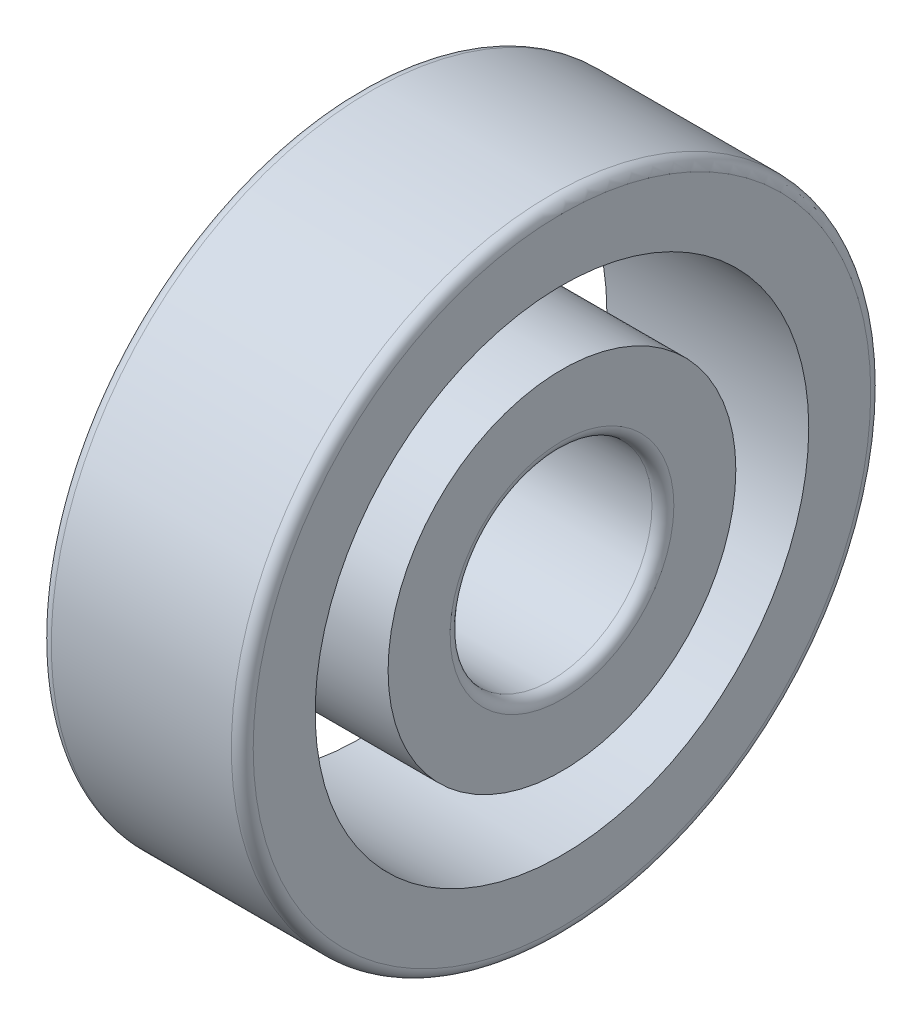
ISO-10303-21;
HEADER;
FILE_DESCRIPTION(('STEP AP214'),'2;1');
FILE_NAME('part.step','',(''),(''),'','','');
FILE_SCHEMA(('AUTOMOTIVE_DESIGN { 1 0 10303 214 1 1 1 1 }'));
ENDSEC;
DATA;
#1=APPLICATION_CONTEXT('core data for automotive mechanical design processes');
#2=APPLICATION_PROTOCOL_DEFINITION('international standard','automotive_design',2000,#1);
#3=PRODUCT_CONTEXT('',#1,'mechanical');
#4=PRODUCT('Part','Part','',(#3));
#5=PRODUCT_RELATED_PRODUCT_CATEGORY('part','',(#4));
#6=PRODUCT_DEFINITION_FORMATION('','',#4);
#7=PRODUCT_DEFINITION_CONTEXT('part definition',#1,'design');
#8=PRODUCT_DEFINITION('design','',#6,#7);
#9=PRODUCT_DEFINITION_SHAPE('','',#8);
#10=(LENGTH_UNIT() NAMED_UNIT(*) SI_UNIT(.MILLI.,.METRE.));
#11=(NAMED_UNIT(*) PLANE_ANGLE_UNIT() SI_UNIT($,.RADIAN.));
#12=(NAMED_UNIT(*) SI_UNIT($,.STERADIAN.) SOLID_ANGLE_UNIT());
#13=UNCERTAINTY_MEASURE_WITH_UNIT(LENGTH_MEASURE(1.E-05),#10,'distance_accuracy_value','');
#14=(GEOMETRIC_REPRESENTATION_CONTEXT(3) GLOBAL_UNCERTAINTY_ASSIGNED_CONTEXT((#13)) GLOBAL_UNIT_ASSIGNED_CONTEXT((#10,
#11,#12)) REPRESENTATION_CONTEXT('',''));
#15=CARTESIAN_POINT('',(0.,0.,0.));
#16=DIRECTION('',(0.,0.,1.));
#17=DIRECTION('',(1.,0.,0.));
#18=AXIS2_PLACEMENT_3D('',#15,#16,#17);
#19=CARTESIAN_POINT('',(0.325000000000005,0.,0.));
#20=DIRECTION('',(1.,0.,0.));
#21=DIRECTION('',(0.,0.,-1.));
#22=AXIS2_PLACEMENT_3D('',#19,#20,#21);
#23=CYLINDRICAL_SURFACE('',#22,3.);
#24=CARTESIAN_POINT('',(5.675,0.,0.));
#25=DIRECTION('',(1.,0.,0.));
#26=DIRECTION('',(0.,0.,-1.));
#27=AXIS2_PLACEMENT_3D('',#24,#25,#26);
#28=CIRCLE('',#27,3.);
#29=CARTESIAN_POINT('',(5.675,0.,-3.));
#30=VERTEX_POINT('',#29);
#31=EDGE_CURVE('P0_E70',#30,#30,#28,.F.);
#32=ORIENTED_EDGE('',*,*,#31,.F.);
#33=EDGE_LOOP('',(#32));
#34=FACE_BOUND('',#33,.T.);
#35=CARTESIAN_POINT('',(0.325000000000005,0.,0.));
#36=DIRECTION('',(1.,0.,0.));
#37=DIRECTION('',(0.,0.,-1.));
#38=AXIS2_PLACEMENT_3D('',#35,#36,#37);
#39=CIRCLE('',#38,3.);
#40=CARTESIAN_POINT('',(0.325000000000005,0.,-3.));
#41=VERTEX_POINT('',#40);
#42=EDGE_CURVE('P0_E68',#41,#41,#39,.T.);
#43=ORIENTED_EDGE('',*,*,#42,.F.);
#44=EDGE_LOOP('',(#43));
#45=FACE_BOUND('',#44,.T.);
#46=ADVANCED_FACE('P0_F31',(#34,#45),#23,.F.);
#47=CARTESIAN_POINT('',(0.325000000000005,0.,0.));
#48=DIRECTION('',(1.,0.,0.));
#49=DIRECTION('',(0.,0.,-1.));
#50=AXIS2_PLACEMENT_3D('',#47,#48,#49);
#51=TOROIDAL_SURFACE('',#50,3.325,0.325);
#52=CARTESIAN_POINT('',(0.,0.,0.));
#53=DIRECTION('',(-1.,0.,0.));
#54=DIRECTION('',(0.,1.,0.));
#55=AXIS2_PLACEMENT_3D('',#52,#53,#54);
#56=CIRCLE('',#55,3.325);
#57=CARTESIAN_POINT('',(0.,3.325,0.));
#58=VERTEX_POINT('',#57);
#59=EDGE_CURVE('P0_E75',#58,#58,#56,.F.);
#60=ORIENTED_EDGE('',*,*,#59,.F.);
#61=EDGE_LOOP('',(#60));
#62=FACE_BOUND('',#61,.T.);
#63=ORIENTED_EDGE('',*,*,#42,.T.);
#64=EDGE_LOOP('',(#63));
#65=FACE_BOUND('',#64,.T.);
#66=ADVANCED_FACE('P0_F50',(#62,#65),#51,.T.);
#67=CARTESIAN_POINT('',(5.675,0.,0.));
#68=DIRECTION('',(1.,0.,0.));
#69=DIRECTION('',(0.,0.,-1.));
#70=AXIS2_PLACEMENT_3D('',#67,#68,#69);
#71=TOROIDAL_SURFACE('',#70,3.325,0.325);
#72=ORIENTED_EDGE('',*,*,#31,.T.);
#73=EDGE_LOOP('',(#72));
#74=FACE_BOUND('',#73,.T.);
#75=CARTESIAN_POINT('',(6.,0.,0.));
#76=DIRECTION('',(1.,0.,0.));
#77=DIRECTION('',(0.,1.,0.));
#78=AXIS2_PLACEMENT_3D('',#75,#76,#77);
#79=CIRCLE('',#78,3.325);
#80=CARTESIAN_POINT('',(6.,3.325,0.));
#81=VERTEX_POINT('',#80);
#82=EDGE_CURVE('P0_E42',#81,#81,#79,.F.);
#83=ORIENTED_EDGE('',*,*,#82,.F.);
#84=EDGE_LOOP('',(#83));
#85=FACE_BOUND('',#84,.T.);
#86=ADVANCED_FACE('P0_F61',(#74,#85),#71,.T.);
#87=CARTESIAN_POINT('',(0.,4.08333333333333,0.));
#88=DIRECTION('',(-1.,0.,0.));
#89=DIRECTION('',(0.,0.,1.));
#90=AXIS2_PLACEMENT_3D('',#87,#88,#89);
#91=PLANE('',#90);
#92=ORIENTED_EDGE('',*,*,#59,.T.);
#93=EDGE_LOOP('',(#92));
#94=FACE_BOUND('',#93,.T.);
#95=CARTESIAN_POINT('',(0.,0.,0.));
#96=DIRECTION('',(1.,0.,0.));
#97=DIRECTION('',(0.,0.,-1.));
#98=AXIS2_PLACEMENT_3D('',#95,#96,#97);
#99=CIRCLE('',#98,5.16666666666667);
#100=CARTESIAN_POINT('',(0.,0.,-5.16666666666667));
#101=VERTEX_POINT('',#100);
#102=EDGE_CURVE('P0_E35',#101,#101,#99,.T.);
#103=ORIENTED_EDGE('',*,*,#102,.F.);
#104=EDGE_LOOP('',(#103));
#105=FACE_BOUND('',#104,.T.);
#106=ADVANCED_FACE('P0_F84',(#94,#105),#91,.T.);
#107=CARTESIAN_POINT('',(6.,4.08333333333333,0.));
#108=DIRECTION('',(1.,0.,0.));
#109=DIRECTION('',(0.,0.,-1.));
#110=AXIS2_PLACEMENT_3D('',#107,#108,#109);
#111=PLANE('',#110);
#112=ORIENTED_EDGE('',*,*,#82,.T.);
#113=EDGE_LOOP('',(#112));
#114=FACE_BOUND('',#113,.T.);
#115=CARTESIAN_POINT('',(6.,0.,0.));
#116=DIRECTION('',(1.,0.,0.));
#117=DIRECTION('',(0.,0.,-1.));
#118=AXIS2_PLACEMENT_3D('',#115,#116,#117);
#119=CIRCLE('',#118,5.16666666666667);
#120=CARTESIAN_POINT('',(6.,0.,-5.16666666666667));
#121=VERTEX_POINT('',#120);
#122=EDGE_CURVE('P0_E10',#121,#121,#119,.F.);
#123=ORIENTED_EDGE('',*,*,#122,.F.);
#124=EDGE_LOOP('',(#123));
#125=FACE_BOUND('',#124,.T.);
#126=ADVANCED_FACE('P0_F92',(#114,#125),#111,.T.);
#127=CARTESIAN_POINT('',(3.00000000000001,0.,0.));
#128=DIRECTION('',(1.,0.,0.));
#129=DIRECTION('',(0.,0.,-1.));
#130=AXIS2_PLACEMENT_3D('',#127,#128,#129);
#131=CYLINDRICAL_SURFACE('',#130,5.16666666666667);
#132=ORIENTED_EDGE('',*,*,#102,.T.);
#133=EDGE_LOOP('',(#132));
#134=FACE_BOUND('',#133,.T.);
#135=ORIENTED_EDGE('',*,*,#122,.T.);
#136=EDGE_LOOP('',(#135));
#137=FACE_BOUND('',#136,.T.);
#138=ADVANCED_FACE('P0_F33',(#134,#137),#131,.T.);
#139=CLOSED_SHELL('',(#46,#66,#86,#106,#126,#138));
#140=MANIFOLD_SOLID_BREP('P0_B2',#139);
#141=CARTESIAN_POINT('',(0.,0.,0.));
#142=DIRECTION('',(1.,0.,0.));
#143=DIRECTION('',(0.,0.,-1.));
#144=AXIS2_PLACEMENT_3D('',#141,#142,#143);
#145=CYLINDRICAL_SURFACE('',#144,7.33333333333333);
#146=CARTESIAN_POINT('',(0.,0.,0.));
#147=DIRECTION('',(1.,0.,0.));
#148=DIRECTION('',(0.,0.,-1.));
#149=AXIS2_PLACEMENT_3D('',#146,#147,#148);
#150=CIRCLE('',#149,7.33333333333333);
#151=CARTESIAN_POINT('',(0.,0.,-7.33333333333333));
#152=VERTEX_POINT('',#151);
#153=EDGE_CURVE('P1_E18',#152,#152,#150,.T.);
#154=ORIENTED_EDGE('',*,*,#153,.F.);
#155=EDGE_LOOP('',(#154));
#156=FACE_BOUND('',#155,.T.);
#157=CARTESIAN_POINT('',(6.,0.,0.));
#158=DIRECTION('',(1.,0.,0.));
#159=DIRECTION('',(0.,0.,-1.));
#160=AXIS2_PLACEMENT_3D('',#157,#158,#159);
#161=CIRCLE('',#160,7.33333333333333);
#162=CARTESIAN_POINT('',(6.,0.,-7.33333333333333));
#163=VERTEX_POINT('',#162);
#164=EDGE_CURVE('P1_E102',#163,#163,#161,.F.);
#165=ORIENTED_EDGE('',*,*,#164,.F.);
#166=EDGE_LOOP('',(#165));
#167=FACE_BOUND('',#166,.T.);
#168=ADVANCED_FACE('P1_F14',(#156,#167),#145,.F.);
#169=CARTESIAN_POINT('',(0.,8.41666666666667,0.));
#170=DIRECTION('',(-1.,0.,0.));
#171=DIRECTION('',(0.,0.,1.));
#172=AXIS2_PLACEMENT_3D('',#169,#170,#171);
#173=PLANE('',#172);
#174=CARTESIAN_POINT('',(0.,0.,0.));
#175=DIRECTION('',(1.,0.,0.));
#176=DIRECTION('',(0.,1.,0.));
#177=AXIS2_PLACEMENT_3D('',#174,#175,#176);
#178=CIRCLE('',#177,9.175);
#179=CARTESIAN_POINT('',(0.,9.175,0.));
#180=VERTEX_POINT('',#179);
#181=EDGE_CURVE('P1_E101',#180,#180,#178,.T.);
#182=ORIENTED_EDGE('',*,*,#181,.F.);
#183=EDGE_LOOP('',(#182));
#184=FACE_BOUND('',#183,.T.);
#185=ORIENTED_EDGE('',*,*,#153,.T.);
#186=EDGE_LOOP('',(#185));
#187=FACE_BOUND('',#186,.T.);
#188=ADVANCED_FACE('P1_F75',(#184,#187),#173,.T.);
#189=CARTESIAN_POINT('',(6.,8.41666666666667,0.));
#190=DIRECTION('',(1.,0.,0.));
#191=DIRECTION('',(0.,0.,-1.));
#192=AXIS2_PLACEMENT_3D('',#189,#190,#191);
#193=PLANE('',#192);
#194=CARTESIAN_POINT('',(6.,0.,0.));
#195=DIRECTION('',(-1.,0.,0.));
#196=DIRECTION('',(0.,1.,0.));
#197=AXIS2_PLACEMENT_3D('',#194,#195,#196);
#198=CIRCLE('',#197,9.175);
#199=CARTESIAN_POINT('',(6.,9.175,0.));
#200=VERTEX_POINT('',#199);
#201=EDGE_CURVE('P1_E27',#200,#200,#198,.T.);
#202=ORIENTED_EDGE('',*,*,#201,.F.);
#203=EDGE_LOOP('',(#202));
#204=FACE_BOUND('',#203,.T.);
#205=ORIENTED_EDGE('',*,*,#164,.T.);
#206=EDGE_LOOP('',(#205));
#207=FACE_BOUND('',#206,.T.);
#208=ADVANCED_FACE('P1_F55',(#204,#207),#193,.T.);
#209=CARTESIAN_POINT('',(0.325000000000005,0.,0.));
#210=DIRECTION('',(1.,0.,0.));
#211=DIRECTION('',(0.,0.,-1.));
#212=AXIS2_PLACEMENT_3D('',#209,#210,#211);
#213=TOROIDAL_SURFACE('',#212,9.175,0.325);
#214=CARTESIAN_POINT('',(0.325000000000005,0.,0.));
#215=DIRECTION('',(1.,0.,0.));
#216=DIRECTION('',(0.,0.,-1.));
#217=AXIS2_PLACEMENT_3D('',#214,#215,#216);
#218=CIRCLE('',#217,9.5);
#219=CARTESIAN_POINT('',(0.325000000000005,0.,-9.5));
#220=VERTEX_POINT('',#219);
#221=EDGE_CURVE('P1_E22',#220,#220,#218,.T.);
#222=ORIENTED_EDGE('',*,*,#221,.F.);
#223=EDGE_LOOP('',(#222));
#224=FACE_BOUND('',#223,.T.);
#225=ORIENTED_EDGE('',*,*,#181,.T.);
#226=EDGE_LOOP('',(#225));
#227=FACE_BOUND('',#226,.T.);
#228=ADVANCED_FACE('P1_F51',(#224,#227),#213,.T.);
#229=CARTESIAN_POINT('',(5.675,0.,0.));
#230=DIRECTION('',(1.,0.,0.));
#231=DIRECTION('',(0.,0.,-1.));
#232=AXIS2_PLACEMENT_3D('',#229,#230,#231);
#233=TOROIDAL_SURFACE('',#232,9.175,0.325);
#234=ORIENTED_EDGE('',*,*,#201,.T.);
#235=EDGE_LOOP('',(#234));
#236=FACE_BOUND('',#235,.T.);
#237=CARTESIAN_POINT('',(5.675,0.,0.));
#238=DIRECTION('',(1.,0.,0.));
#239=DIRECTION('',(0.,0.,-1.));
#240=AXIS2_PLACEMENT_3D('',#237,#238,#239);
#241=CIRCLE('',#240,9.5);
#242=CARTESIAN_POINT('',(5.675,0.,-9.5));
#243=VERTEX_POINT('',#242);
#244=EDGE_CURVE('P1_E9',#243,#243,#241,.F.);
#245=ORIENTED_EDGE('',*,*,#244,.F.);
#246=EDGE_LOOP('',(#245));
#247=FACE_BOUND('',#246,.T.);
#248=ADVANCED_FACE('P1_F42',(#236,#247),#233,.T.);
#249=CARTESIAN_POINT('',(3.,0.,0.));
#250=DIRECTION('',(1.,0.,0.));
#251=DIRECTION('',(0.,0.,-1.));
#252=AXIS2_PLACEMENT_3D('',#249,#250,#251);
#253=CYLINDRICAL_SURFACE('',#252,9.5);
#254=ORIENTED_EDGE('',*,*,#221,.T.);
#255=EDGE_LOOP('',(#254));
#256=FACE_BOUND('',#255,.T.);
#257=ORIENTED_EDGE('',*,*,#244,.T.);
#258=EDGE_LOOP('',(#257));
#259=FACE_BOUND('',#258,.T.);
#260=ADVANCED_FACE('P1_F16',(#256,#259),#253,.T.);
#261=CLOSED_SHELL('',(#168,#188,#208,#228,#248,#260));
#262=MANIFOLD_SOLID_BREP('P1_B1',#261);
#263=ADVANCED_BREP_SHAPE_REPRESENTATION('',(#18,#140,#262),#14);
#264=SHAPE_DEFINITION_REPRESENTATION(#9,#263);
ENDSEC;
END-ISO-10303-21;
